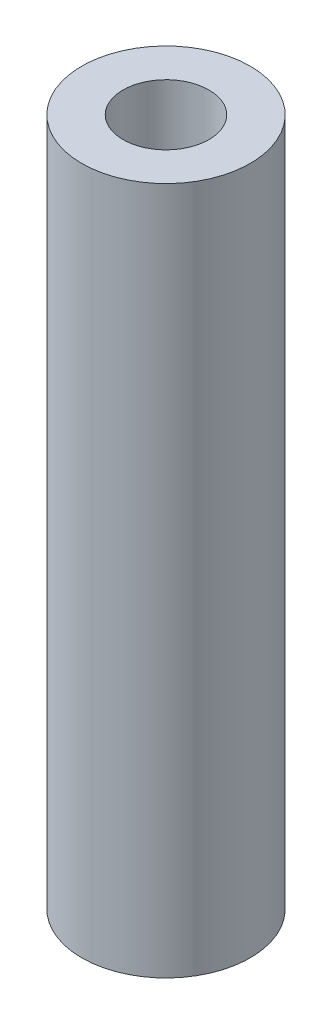
ISO-10303-21;
HEADER;
FILE_DESCRIPTION(('STEP AP214'),'2;1');
FILE_NAME('part.step','',(''),(''),'','','');
FILE_SCHEMA(('AUTOMOTIVE_DESIGN { 1 0 10303 214 1 1 1 1 }'));
ENDSEC;
DATA;
#1=APPLICATION_CONTEXT('core data for automotive mechanical design processes');
#2=APPLICATION_PROTOCOL_DEFINITION('international standard','automotive_design',2000,#1);
#3=PRODUCT_CONTEXT('',#1,'mechanical');
#4=PRODUCT('Part','Part','',(#3));
#5=PRODUCT_RELATED_PRODUCT_CATEGORY('part','',(#4));
#6=PRODUCT_DEFINITION_FORMATION('','',#4);
#7=PRODUCT_DEFINITION_CONTEXT('part definition',#1,'design');
#8=PRODUCT_DEFINITION('design','',#6,#7);
#9=PRODUCT_DEFINITION_SHAPE('','',#8);
#10=(LENGTH_UNIT() NAMED_UNIT(*) SI_UNIT(.MILLI.,.METRE.));
#11=(NAMED_UNIT(*) PLANE_ANGLE_UNIT() SI_UNIT($,.RADIAN.));
#12=(NAMED_UNIT(*) SI_UNIT($,.STERADIAN.) SOLID_ANGLE_UNIT());
#13=UNCERTAINTY_MEASURE_WITH_UNIT(LENGTH_MEASURE(1.E-05),#10,'distance_accuracy_value','');
#14=(GEOMETRIC_REPRESENTATION_CONTEXT(3) GLOBAL_UNCERTAINTY_ASSIGNED_CONTEXT((#13)) GLOBAL_UNIT_ASSIGNED_CONTEXT((#10,
#11,#12)) REPRESENTATION_CONTEXT('',''));
#15=CARTESIAN_POINT('',(0.,0.,0.));
#16=DIRECTION('',(0.,0.,1.));
#17=DIRECTION('',(1.,0.,0.));
#18=AXIS2_PLACEMENT_3D('',#15,#16,#17);
#19=CARTESIAN_POINT('',(0.,25.4,0.));
#20=DIRECTION('',(0.,1.,0.));
#21=DIRECTION('',(0.,0.,-1.));
#22=AXIS2_PLACEMENT_3D('',#19,#20,#21);
#23=PLANE('',#22);
#24=CARTESIAN_POINT('',(0.,25.4,0.));
#25=DIRECTION('',(0.,-1.,0.));
#26=DIRECTION('',(0.,0.,-1.));
#27=AXIS2_PLACEMENT_3D('',#24,#25,#26);
#28=CIRCLE('',#27,3.1115);
#29=CARTESIAN_POINT('',(0.,25.4,-3.1115));
#30=VERTEX_POINT('',#29);
#31=EDGE_CURVE('E10',#30,#30,#28,.T.);
#32=ORIENTED_EDGE('',*,*,#31,.F.);
#33=EDGE_LOOP('',(#32));
#34=FACE_BOUND('',#33,.T.);
#35=CARTESIAN_POINT('',(0.,25.4,0.));
#36=DIRECTION('',(0.,-1.,0.));
#37=DIRECTION('',(0.,0.,-1.));
#38=AXIS2_PLACEMENT_3D('',#35,#36,#37);
#39=CIRCLE('',#38,1.5875);
#40=CARTESIAN_POINT('',(0.,25.4,-1.5875));
#41=VERTEX_POINT('',#40);
#42=EDGE_CURVE('E48',#41,#41,#39,.T.);
#43=ORIENTED_EDGE('',*,*,#42,.T.);
#44=EDGE_LOOP('',(#43));
#45=FACE_BOUND('',#44,.T.);
#46=ADVANCED_FACE('F37',(#34,#45),#23,.T.);
#47=CARTESIAN_POINT('',(0.,0.,0.));
#48=DIRECTION('',(0.,1.,0.));
#49=DIRECTION('',(0.,0.,-1.));
#50=AXIS2_PLACEMENT_3D('',#47,#48,#49);
#51=PLANE('',#50);
#52=CARTESIAN_POINT('',(0.,0.,0.));
#53=DIRECTION('',(0.,-1.,0.));
#54=DIRECTION('',(0.,0.,-1.));
#55=AXIS2_PLACEMENT_3D('',#52,#53,#54);
#56=CIRCLE('',#55,3.1115);
#57=CARTESIAN_POINT('',(0.,0.,-3.1115));
#58=VERTEX_POINT('',#57);
#59=EDGE_CURVE('E41',#58,#58,#56,.T.);
#60=ORIENTED_EDGE('',*,*,#59,.T.);
#61=EDGE_LOOP('',(#60));
#62=FACE_BOUND('',#61,.T.);
#63=CARTESIAN_POINT('',(0.,0.,0.));
#64=DIRECTION('',(0.,-1.,0.));
#65=DIRECTION('',(0.,0.,-1.));
#66=AXIS2_PLACEMENT_3D('',#63,#64,#65);
#67=CIRCLE('',#66,1.5875);
#68=CARTESIAN_POINT('',(0.,0.,-1.5875));
#69=VERTEX_POINT('',#68);
#70=EDGE_CURVE('E50',#69,#69,#67,.T.);
#71=ORIENTED_EDGE('',*,*,#70,.F.);
#72=EDGE_LOOP('',(#71));
#73=FACE_BOUND('',#72,.T.);
#74=ADVANCED_FACE('F63',(#62,#73),#51,.F.);
#75=CARTESIAN_POINT('',(0.,25.4,0.));
#76=DIRECTION('',(0.,-1.,0.));
#77=DIRECTION('',(0.,0.,1.));
#78=AXIS2_PLACEMENT_3D('',#75,#76,#77);
#79=CYLINDRICAL_SURFACE('',#78,3.1115);
#80=ORIENTED_EDGE('',*,*,#31,.T.);
#81=EDGE_LOOP('',(#80));
#82=FACE_BOUND('',#81,.T.);
#83=ORIENTED_EDGE('',*,*,#59,.F.);
#84=EDGE_LOOP('',(#83));
#85=FACE_BOUND('',#84,.T.);
#86=ADVANCED_FACE('F39',(#82,#85),#79,.T.);
#87=CARTESIAN_POINT('',(0.,25.4,0.));
#88=DIRECTION('',(0.,-1.,0.));
#89=DIRECTION('',(0.,0.,1.));
#90=AXIS2_PLACEMENT_3D('',#87,#88,#89);
#91=CYLINDRICAL_SURFACE('',#90,1.5875);
#92=ORIENTED_EDGE('',*,*,#42,.F.);
#93=EDGE_LOOP('',(#92));
#94=FACE_BOUND('',#93,.T.);
#95=ORIENTED_EDGE('',*,*,#70,.T.);
#96=EDGE_LOOP('',(#95));
#97=FACE_BOUND('',#96,.T.);
#98=ADVANCED_FACE('F57',(#94,#97),#91,.F.);
#99=CLOSED_SHELL('',(#46,#74,#86,#98));
#100=MANIFOLD_SOLID_BREP('B2',#99);
#101=ADVANCED_BREP_SHAPE_REPRESENTATION('',(#18,#100),#14);
#102=SHAPE_DEFINITION_REPRESENTATION(#9,#101);
ENDSEC;
END-ISO-10303-21;
